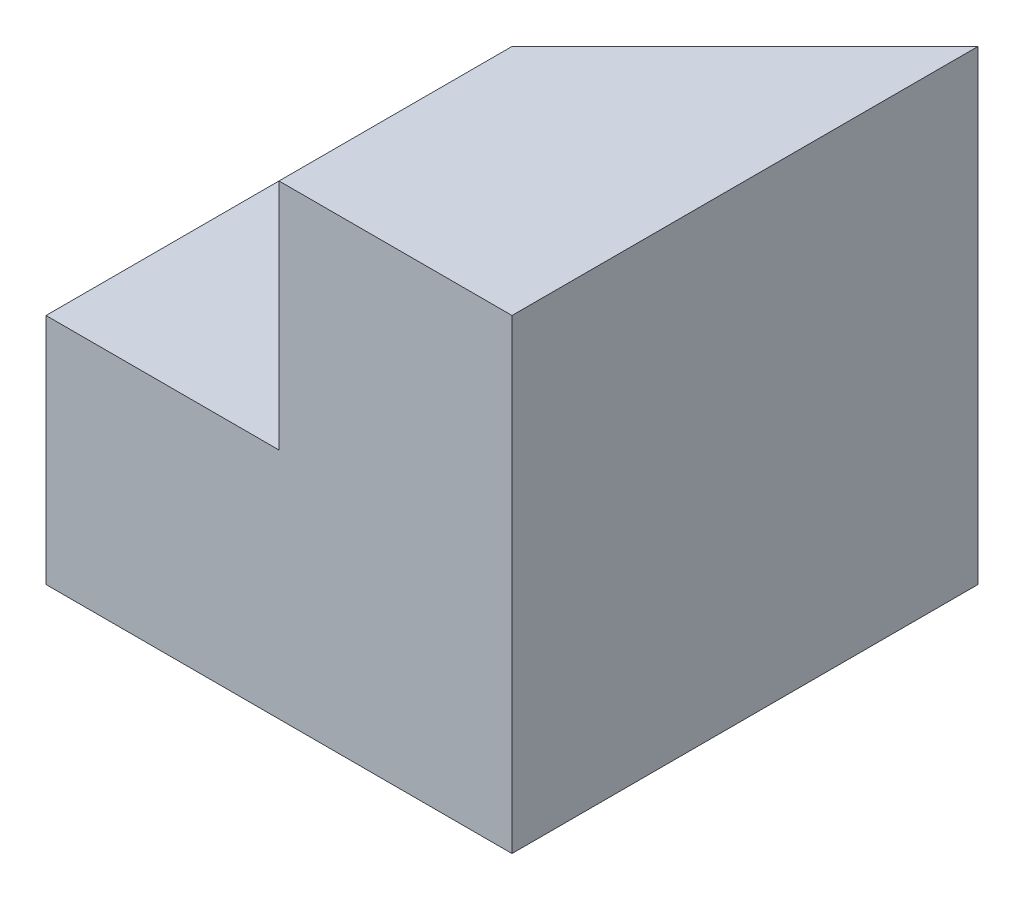
ISO-10303-21;
HEADER;
FILE_DESCRIPTION(('STEP AP214'),'2;1');
FILE_NAME('part.step','',(''),(''),'','','');
FILE_SCHEMA(('AUTOMOTIVE_DESIGN { 1 0 10303 214 1 1 1 1 }'));
ENDSEC;
DATA;
#1=APPLICATION_CONTEXT('core data for automotive mechanical design processes');
#2=APPLICATION_PROTOCOL_DEFINITION('international standard','automotive_design',2000,#1);
#3=PRODUCT_CONTEXT('',#1,'mechanical');
#4=PRODUCT('Part','Part','',(#3));
#5=PRODUCT_RELATED_PRODUCT_CATEGORY('part','',(#4));
#6=PRODUCT_DEFINITION_FORMATION('','',#4);
#7=PRODUCT_DEFINITION_CONTEXT('part definition',#1,'design');
#8=PRODUCT_DEFINITION('design','',#6,#7);
#9=PRODUCT_DEFINITION_SHAPE('','',#8);
#10=(LENGTH_UNIT() NAMED_UNIT(*) SI_UNIT(.MILLI.,.METRE.));
#11=(NAMED_UNIT(*) PLANE_ANGLE_UNIT() SI_UNIT($,.RADIAN.));
#12=(NAMED_UNIT(*) SI_UNIT($,.STERADIAN.) SOLID_ANGLE_UNIT());
#13=UNCERTAINTY_MEASURE_WITH_UNIT(LENGTH_MEASURE(1.E-05),#10,'distance_accuracy_value','');
#14=(GEOMETRIC_REPRESENTATION_CONTEXT(3) GLOBAL_UNCERTAINTY_ASSIGNED_CONTEXT((#13)) GLOBAL_UNIT_ASSIGNED_CONTEXT((#10,
#11,#12)) REPRESENTATION_CONTEXT('',''));
#15=CARTESIAN_POINT('',(0.,0.,0.));
#16=DIRECTION('',(0.,0.,1.));
#17=DIRECTION('',(1.,0.,0.));
#18=AXIS2_PLACEMENT_3D('',#15,#16,#17);
#19=CARTESIAN_POINT('',(0.,0.,0.));
#20=DIRECTION('',(0.,0.,-1.));
#21=DIRECTION('',(-1.,0.,0.));
#22=AXIS2_PLACEMENT_3D('',#19,#20,#21);
#23=PLANE('',#22);
#24=DIRECTION('',(1.,0.,0.));
#25=VECTOR('',#24,1.);
#26=CARTESIAN_POINT('',(0.,20.,0.));
#27=LINE('',#26,#25);
#28=CARTESIAN_POINT('',(0.,20.,0.));
#29=VERTEX_POINT('',#28);
#30=CARTESIAN_POINT('',(40.,20.,0.));
#31=VERTEX_POINT('',#30);
#32=EDGE_CURVE('E72',#29,#31,#27,.T.);
#33=ORIENTED_EDGE('',*,*,#32,.T.);
#34=DIRECTION('',(0.,1.,0.));
#35=VECTOR('',#34,1.);
#36=CARTESIAN_POINT('',(40.,0.,0.));
#37=LINE('',#36,#35);
#38=CARTESIAN_POINT('',(40.,0.,0.));
#39=VERTEX_POINT('',#38);
#40=EDGE_CURVE('E95',#39,#31,#37,.T.);
#41=ORIENTED_EDGE('',*,*,#40,.F.);
#42=DIRECTION('',(1.,0.,0.));
#43=VECTOR('',#42,1.);
#44=CARTESIAN_POINT('',(0.,0.,0.));
#45=LINE('',#44,#43);
#46=CARTESIAN_POINT('',(0.,0.,0.));
#47=VERTEX_POINT('',#46);
#48=EDGE_CURVE('E130',#47,#39,#45,.T.);
#49=ORIENTED_EDGE('',*,*,#48,.F.);
#50=DIRECTION('',(0.,-1.,0.));
#51=VECTOR('',#50,1.);
#52=CARTESIAN_POINT('',(0.,0.,0.));
#53=LINE('',#52,#51);
#54=EDGE_CURVE('E62',#29,#47,#53,.T.);
#55=ORIENTED_EDGE('',*,*,#54,.F.);
#56=EDGE_LOOP('',(#33,#41,#49,#55));
#57=FACE_BOUND('',#56,.T.);
#58=ADVANCED_FACE('F33',(#57),#23,.T.);
#59=CARTESIAN_POINT('',(0.,0.,40.));
#60=DIRECTION('',(1.,0.,0.));
#61=DIRECTION('',(0.,0.,-1.));
#62=AXIS2_PLACEMENT_3D('',#59,#60,#61);
#63=PLANE('',#62);
#64=DIRECTION('',(0.,-1.,0.));
#65=VECTOR('',#64,1.);
#66=CARTESIAN_POINT('',(0.,0.,40.));
#67=LINE('',#66,#65);
#68=CARTESIAN_POINT('',(0.,20.,40.));
#69=VERTEX_POINT('',#68);
#70=CARTESIAN_POINT('',(0.,0.,40.));
#71=VERTEX_POINT('',#70);
#72=EDGE_CURVE('E87',#69,#71,#67,.T.);
#73=ORIENTED_EDGE('',*,*,#72,.F.);
#74=DIRECTION('',(0.,0.,1.));
#75=VECTOR('',#74,1.);
#76=CARTESIAN_POINT('',(0.,20.,0.));
#77=LINE('',#76,#75);
#78=EDGE_CURVE('E146',#29,#69,#77,.T.);
#79=ORIENTED_EDGE('',*,*,#78,.F.);
#80=ORIENTED_EDGE('',*,*,#54,.T.);
#81=DIRECTION('',(0.,0.,-1.));
#82=VECTOR('',#81,1.);
#83=CARTESIAN_POINT('',(0.,0.,40.));
#84=LINE('',#83,#82);
#85=EDGE_CURVE('E11',#71,#47,#84,.T.);
#86=ORIENTED_EDGE('',*,*,#85,.F.);
#87=EDGE_LOOP('',(#73,#79,#80,#86));
#88=FACE_BOUND('',#87,.T.);
#89=ADVANCED_FACE('F35',(#88),#63,.F.);
#90=CARTESIAN_POINT('',(0.,0.,40.));
#91=DIRECTION('',(0.,1.,0.));
#92=DIRECTION('',(0.,0.,1.));
#93=AXIS2_PLACEMENT_3D('',#90,#91,#92);
#94=PLANE('',#93);
#95=ORIENTED_EDGE('',*,*,#48,.T.);
#96=DIRECTION('',(0.,0.,-1.));
#97=VECTOR('',#96,1.);
#98=CARTESIAN_POINT('',(40.,0.,40.));
#99=LINE('',#98,#97);
#100=CARTESIAN_POINT('',(40.,0.,40.));
#101=VERTEX_POINT('',#100);
#102=EDGE_CURVE('E42',#101,#39,#99,.T.);
#103=ORIENTED_EDGE('',*,*,#102,.F.);
#104=DIRECTION('',(1.,0.,0.));
#105=VECTOR('',#104,1.);
#106=CARTESIAN_POINT('',(0.,0.,40.));
#107=LINE('',#106,#105);
#108=EDGE_CURVE('E90',#71,#101,#107,.T.);
#109=ORIENTED_EDGE('',*,*,#108,.F.);
#110=ORIENTED_EDGE('',*,*,#85,.T.);
#111=EDGE_LOOP('',(#95,#103,#109,#110));
#112=FACE_BOUND('',#111,.T.);
#113=ADVANCED_FACE('F98',(#112),#94,.F.);
#114=CARTESIAN_POINT('',(40.,0.,40.));
#115=DIRECTION('',(-1.,0.,0.));
#116=DIRECTION('',(0.,0.,1.));
#117=AXIS2_PLACEMENT_3D('',#114,#115,#116);
#118=PLANE('',#117);
#119=ORIENTED_EDGE('',*,*,#40,.T.);
#120=DIRECTION('',(0.,1.,0.));
#121=VECTOR('',#120,1.);
#122=CARTESIAN_POINT('',(40.,20.,0.));
#123=LINE('',#122,#121);
#124=CARTESIAN_POINT('',(40.,40.,0.));
#125=VERTEX_POINT('',#124);
#126=EDGE_CURVE('E126',#31,#125,#123,.T.);
#127=ORIENTED_EDGE('',*,*,#126,.T.);
#128=DIRECTION('',(0.,0.,-1.));
#129=VECTOR('',#128,1.);
#130=CARTESIAN_POINT('',(40.,40.,40.));
#131=LINE('',#130,#129);
#132=CARTESIAN_POINT('',(40.,40.,40.));
#133=VERTEX_POINT('',#132);
#134=EDGE_CURVE('E135',#133,#125,#131,.T.);
#135=ORIENTED_EDGE('',*,*,#134,.F.);
#136=DIRECTION('',(0.,1.,0.));
#137=VECTOR('',#136,1.);
#138=CARTESIAN_POINT('',(40.,0.,40.));
#139=LINE('',#138,#137);
#140=EDGE_CURVE('E50',#101,#133,#139,.T.);
#141=ORIENTED_EDGE('',*,*,#140,.F.);
#142=ORIENTED_EDGE('',*,*,#102,.T.);
#143=EDGE_LOOP('',(#119,#127,#135,#141,#142));
#144=FACE_BOUND('',#143,.T.);
#145=ADVANCED_FACE('F106',(#144),#118,.F.);
#146=CARTESIAN_POINT('',(0.,40.,40.));
#147=DIRECTION('',(0.,-1.,0.));
#148=DIRECTION('',(0.,0.,-1.));
#149=AXIS2_PLACEMENT_3D('',#146,#147,#148);
#150=PLANE('',#149);
#151=ORIENTED_EDGE('',*,*,#134,.T.);
#152=DIRECTION('',(0.707106781186547,0.,-0.707106781186548));
#153=VECTOR('',#152,1.);
#154=CARTESIAN_POINT('',(40.,40.,0.));
#155=LINE('',#154,#153);
#156=CARTESIAN_POINT('',(20.,40.,20.));
#157=VERTEX_POINT('',#156);
#158=EDGE_CURVE('E160',#157,#125,#155,.T.);
#159=ORIENTED_EDGE('',*,*,#158,.F.);
#160=DIRECTION('',(0.,0.,1.));
#161=VECTOR('',#160,1.);
#162=CARTESIAN_POINT('',(20.,40.,0.));
#163=LINE('',#162,#161);
#164=CARTESIAN_POINT('',(20.,40.,40.));
#165=VERTEX_POINT('',#164);
#166=EDGE_CURVE('E141',#157,#165,#163,.T.);
#167=ORIENTED_EDGE('',*,*,#166,.T.);
#168=DIRECTION('',(-1.,0.,0.));
#169=VECTOR('',#168,1.);
#170=CARTESIAN_POINT('',(0.,40.,40.));
#171=LINE('',#170,#169);
#172=EDGE_CURVE('E136',#133,#165,#171,.T.);
#173=ORIENTED_EDGE('',*,*,#172,.F.);
#174=EDGE_LOOP('',(#151,#159,#167,#173));
#175=FACE_BOUND('',#174,.T.);
#176=ADVANCED_FACE('F114',(#175),#150,.F.);
#177=CARTESIAN_POINT('',(0.,0.,40.));
#178=DIRECTION('',(0.,0.,-1.));
#179=DIRECTION('',(-1.,0.,0.));
#180=AXIS2_PLACEMENT_3D('',#177,#178,#179);
#181=PLANE('',#180);
#182=ORIENTED_EDGE('',*,*,#172,.T.);
#183=DIRECTION('',(0.,1.,0.));
#184=VECTOR('',#183,1.);
#185=CARTESIAN_POINT('',(20.,40.,40.));
#186=LINE('',#185,#184);
#187=CARTESIAN_POINT('',(20.,20.,40.));
#188=VERTEX_POINT('',#187);
#189=EDGE_CURVE('E149',#188,#165,#186,.T.);
#190=ORIENTED_EDGE('',*,*,#189,.F.);
#191=DIRECTION('',(1.,0.,0.));
#192=VECTOR('',#191,1.);
#193=CARTESIAN_POINT('',(0.,20.,40.));
#194=LINE('',#193,#192);
#195=EDGE_CURVE('E94',#69,#188,#194,.T.);
#196=ORIENTED_EDGE('',*,*,#195,.F.);
#197=ORIENTED_EDGE('',*,*,#72,.T.);
#198=ORIENTED_EDGE('',*,*,#108,.T.);
#199=ORIENTED_EDGE('',*,*,#140,.T.);
#200=EDGE_LOOP('',(#182,#190,#196,#197,#198,#199));
#201=FACE_BOUND('',#200,.T.);
#202=ADVANCED_FACE('F89',(#201),#181,.F.);
#203=CARTESIAN_POINT('',(20.,40.,0.));
#204=DIRECTION('',(1.,0.,0.));
#205=DIRECTION('',(0.,1.,0.));
#206=AXIS2_PLACEMENT_3D('',#203,#204,#205);
#207=PLANE('',#206);
#208=ORIENTED_EDGE('',*,*,#166,.F.);
#209=DIRECTION('',(0.,1.,0.));
#210=VECTOR('',#209,1.);
#211=CARTESIAN_POINT('',(20.,20.,20.));
#212=LINE('',#211,#210);
#213=CARTESIAN_POINT('',(20.,20.,20.));
#214=VERTEX_POINT('',#213);
#215=EDGE_CURVE('E154',#214,#157,#212,.T.);
#216=ORIENTED_EDGE('',*,*,#215,.F.);
#217=DIRECTION('',(0.,0.,1.));
#218=VECTOR('',#217,1.);
#219=CARTESIAN_POINT('',(20.,20.,0.));
#220=LINE('',#219,#218);
#221=EDGE_CURVE('E142',#214,#188,#220,.T.);
#222=ORIENTED_EDGE('',*,*,#221,.T.);
#223=ORIENTED_EDGE('',*,*,#189,.T.);
#224=EDGE_LOOP('',(#208,#216,#222,#223));
#225=FACE_BOUND('',#224,.T.);
#226=ADVANCED_FACE('F171',(#225),#207,.F.);
#227=CARTESIAN_POINT('',(0.,20.,0.));
#228=DIRECTION('',(0.,-1.,0.));
#229=DIRECTION('',(0.,0.,-1.));
#230=AXIS2_PLACEMENT_3D('',#227,#228,#229);
#231=PLANE('',#230);
#232=ORIENTED_EDGE('',*,*,#195,.T.);
#233=ORIENTED_EDGE('',*,*,#221,.F.);
#234=DIRECTION('',(0.707106781186547,0.,-0.707106781186548));
#235=VECTOR('',#234,1.);
#236=CARTESIAN_POINT('',(40.,20.,0.));
#237=LINE('',#236,#235);
#238=EDGE_CURVE('E158',#214,#31,#237,.T.);
#239=ORIENTED_EDGE('',*,*,#238,.T.);
#240=ORIENTED_EDGE('',*,*,#32,.F.);
#241=ORIENTED_EDGE('',*,*,#78,.T.);
#242=EDGE_LOOP('',(#232,#233,#239,#240,#241));
#243=FACE_BOUND('',#242,.T.);
#244=ADVANCED_FACE('F164',(#243),#231,.F.);
#245=CARTESIAN_POINT('',(40.,20.,0.));
#246=DIRECTION('',(0.707106781186548,0.,0.707106781186547));
#247=DIRECTION('',(0.707106781186547,0.,-0.707106781186548));
#248=AXIS2_PLACEMENT_3D('',#245,#246,#247);
#249=PLANE('',#248);
#250=ORIENTED_EDGE('',*,*,#158,.T.);
#251=ORIENTED_EDGE('',*,*,#126,.F.);
#252=ORIENTED_EDGE('',*,*,#238,.F.);
#253=ORIENTED_EDGE('',*,*,#215,.T.);
#254=EDGE_LOOP('',(#250,#251,#252,#253));
#255=FACE_BOUND('',#254,.T.);
#256=ADVANCED_FACE('F167',(#255),#249,.F.);
#257=CLOSED_SHELL('',(#58,#89,#113,#145,#176,#202,#226,#244,#256));
#258=MANIFOLD_SOLID_BREP('B2',#257);
#259=ADVANCED_BREP_SHAPE_REPRESENTATION('',(#18,#258),#14);
#260=SHAPE_DEFINITION_REPRESENTATION(#9,#259);
ENDSEC;
END-ISO-10303-21;
